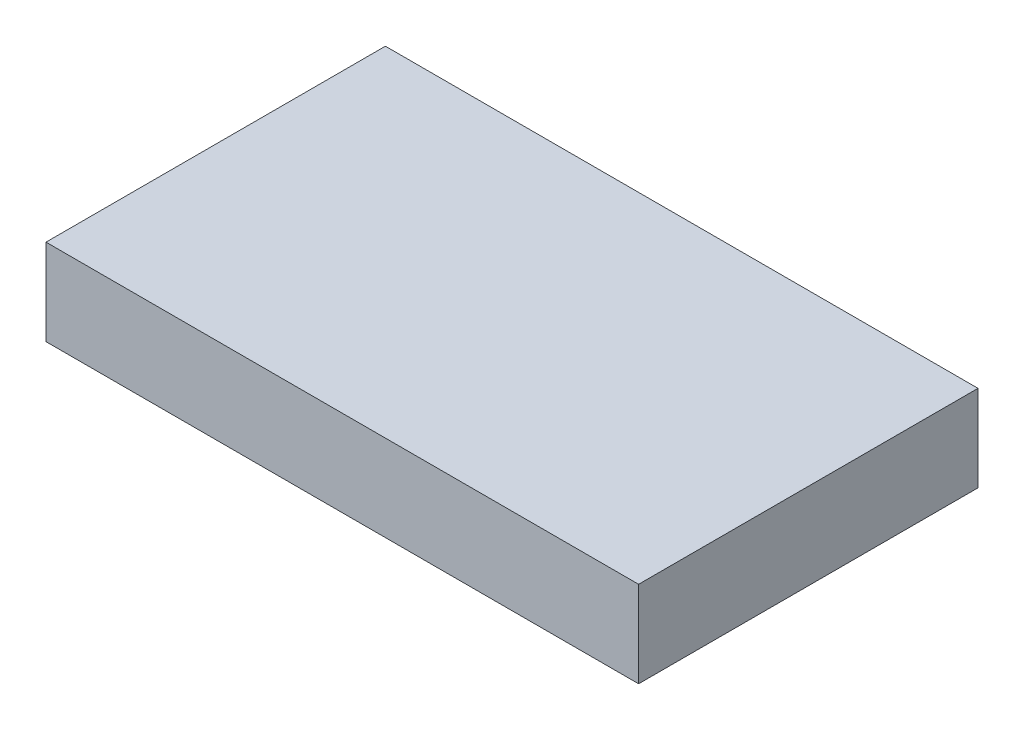
ISO-10303-21;
HEADER;
FILE_DESCRIPTION(('STEP AP214'),'2;1');
FILE_NAME('part.step','',(''),(''),'','','');
FILE_SCHEMA(('AUTOMOTIVE_DESIGN { 1 0 10303 214 1 1 1 1 }'));
ENDSEC;
DATA;
#1=APPLICATION_CONTEXT('core data for automotive mechanical design processes');
#2=APPLICATION_PROTOCOL_DEFINITION('international standard','automotive_design',2000,#1);
#3=PRODUCT_CONTEXT('',#1,'mechanical');
#4=PRODUCT('Part','Part','',(#3));
#5=PRODUCT_RELATED_PRODUCT_CATEGORY('part','',(#4));
#6=PRODUCT_DEFINITION_FORMATION('','',#4);
#7=PRODUCT_DEFINITION_CONTEXT('part definition',#1,'design');
#8=PRODUCT_DEFINITION('design','',#6,#7);
#9=PRODUCT_DEFINITION_SHAPE('','',#8);
#10=(LENGTH_UNIT() NAMED_UNIT(*) SI_UNIT(.MILLI.,.METRE.));
#11=(NAMED_UNIT(*) PLANE_ANGLE_UNIT() SI_UNIT($,.RADIAN.));
#12=(NAMED_UNIT(*) SI_UNIT($,.STERADIAN.) SOLID_ANGLE_UNIT());
#13=UNCERTAINTY_MEASURE_WITH_UNIT(LENGTH_MEASURE(1.E-05),#10,'distance_accuracy_value','');
#14=(GEOMETRIC_REPRESENTATION_CONTEXT(3) GLOBAL_UNCERTAINTY_ASSIGNED_CONTEXT((#13)) GLOBAL_UNIT_ASSIGNED_CONTEXT((#10,
#11,#12)) REPRESENTATION_CONTEXT('',''));
#15=CARTESIAN_POINT('',(0.,0.,0.));
#16=DIRECTION('',(0.,0.,1.));
#17=DIRECTION('',(1.,0.,0.));
#18=AXIS2_PLACEMENT_3D('',#15,#16,#17);
#19=CARTESIAN_POINT('',(33.,0.,9.45));
#20=DIRECTION('',(0.,0.,-1.));
#21=DIRECTION('',(-1.,0.,0.));
#22=AXIS2_PLACEMENT_3D('',#19,#20,#21);
#23=PLANE('',#22);
#24=DIRECTION('',(0.,-1.,0.));
#25=VECTOR('',#24,1.);
#26=CARTESIAN_POINT('',(0.,0.,9.45));
#27=LINE('',#26,#25);
#28=CARTESIAN_POINT('',(0.,4.8,9.45));
#29=VERTEX_POINT('',#28);
#30=CARTESIAN_POINT('',(0.,0.,9.45));
#31=VERTEX_POINT('',#30);
#32=EDGE_CURVE('E95',#29,#31,#27,.T.);
#33=ORIENTED_EDGE('',*,*,#32,.T.);
#34=DIRECTION('',(-1.,0.,0.));
#35=VECTOR('',#34,1.);
#36=CARTESIAN_POINT('',(33.,0.,9.45));
#37=LINE('',#36,#35);
#38=CARTESIAN_POINT('',(33.,0.,9.45));
#39=VERTEX_POINT('',#38);
#40=EDGE_CURVE('E11',#39,#31,#37,.T.);
#41=ORIENTED_EDGE('',*,*,#40,.F.);
#42=DIRECTION('',(0.,-1.,0.));
#43=VECTOR('',#42,1.);
#44=CARTESIAN_POINT('',(33.,0.,9.45));
#45=LINE('',#44,#43);
#46=CARTESIAN_POINT('',(33.,4.8,9.45));
#47=VERTEX_POINT('',#46);
#48=EDGE_CURVE('E83',#47,#39,#45,.T.);
#49=ORIENTED_EDGE('',*,*,#48,.F.);
#50=DIRECTION('',(-1.,0.,0.));
#51=VECTOR('',#50,1.);
#52=CARTESIAN_POINT('',(33.,4.8,9.45));
#53=LINE('',#52,#51);
#54=EDGE_CURVE('E91',#47,#29,#53,.T.);
#55=ORIENTED_EDGE('',*,*,#54,.T.);
#56=EDGE_LOOP('',(#33,#41,#49,#55));
#57=FACE_BOUND('',#56,.T.);
#58=ADVANCED_FACE('F32',(#57),#23,.F.);
#59=CARTESIAN_POINT('',(33.,0.,9.45));
#60=DIRECTION('',(0.,1.,0.));
#61=DIRECTION('',(0.,0.,1.));
#62=AXIS2_PLACEMENT_3D('',#59,#60,#61);
#63=PLANE('',#62);
#64=DIRECTION('',(0.,0.,-1.));
#65=VECTOR('',#64,1.);
#66=CARTESIAN_POINT('',(0.,0.,9.45));
#67=LINE('',#66,#65);
#68=CARTESIAN_POINT('',(0.,0.,-9.45));
#69=VERTEX_POINT('',#68);
#70=EDGE_CURVE('E87',#31,#69,#67,.T.);
#71=ORIENTED_EDGE('',*,*,#70,.T.);
#72=DIRECTION('',(-1.,0.,0.));
#73=VECTOR('',#72,1.);
#74=CARTESIAN_POINT('',(33.,0.,-9.45));
#75=LINE('',#74,#73);
#76=CARTESIAN_POINT('',(33.,0.,-9.45));
#77=VERTEX_POINT('',#76);
#78=EDGE_CURVE('E40',#77,#69,#75,.T.);
#79=ORIENTED_EDGE('',*,*,#78,.F.);
#80=DIRECTION('',(0.,0.,-1.));
#81=VECTOR('',#80,1.);
#82=CARTESIAN_POINT('',(33.,0.,9.45));
#83=LINE('',#82,#81);
#84=EDGE_CURVE('E78',#39,#77,#83,.T.);
#85=ORIENTED_EDGE('',*,*,#84,.F.);
#86=ORIENTED_EDGE('',*,*,#40,.T.);
#87=EDGE_LOOP('',(#71,#79,#85,#86));
#88=FACE_BOUND('',#87,.T.);
#89=ADVANCED_FACE('F86',(#88),#63,.F.);
#90=CARTESIAN_POINT('',(33.,0.,-9.45));
#91=DIRECTION('',(0.,0.,1.));
#92=DIRECTION('',(1.,0.,0.));
#93=AXIS2_PLACEMENT_3D('',#90,#91,#92);
#94=PLANE('',#93);
#95=DIRECTION('',(0.,1.,0.));
#96=VECTOR('',#95,1.);
#97=CARTESIAN_POINT('',(0.,0.,-9.45));
#98=LINE('',#97,#96);
#99=CARTESIAN_POINT('',(0.,4.8,-9.45));
#100=VERTEX_POINT('',#99);
#101=EDGE_CURVE('E65',#69,#100,#98,.T.);
#102=ORIENTED_EDGE('',*,*,#101,.T.);
#103=DIRECTION('',(-1.,0.,0.));
#104=VECTOR('',#103,1.);
#105=CARTESIAN_POINT('',(33.,4.8,-9.45));
#106=LINE('',#105,#104);
#107=CARTESIAN_POINT('',(33.,4.8,-9.45));
#108=VERTEX_POINT('',#107);
#109=EDGE_CURVE('E88',#108,#100,#106,.T.);
#110=ORIENTED_EDGE('',*,*,#109,.F.);
#111=DIRECTION('',(0.,1.,0.));
#112=VECTOR('',#111,1.);
#113=CARTESIAN_POINT('',(33.,0.,-9.45));
#114=LINE('',#113,#112);
#115=EDGE_CURVE('E81',#77,#108,#114,.T.);
#116=ORIENTED_EDGE('',*,*,#115,.F.);
#117=ORIENTED_EDGE('',*,*,#78,.T.);
#118=EDGE_LOOP('',(#102,#110,#116,#117));
#119=FACE_BOUND('',#118,.T.);
#120=ADVANCED_FACE('F89',(#119),#94,.F.);
#121=CARTESIAN_POINT('',(33.,4.8,9.45));
#122=DIRECTION('',(0.,-1.,0.));
#123=DIRECTION('',(0.,0.,-1.));
#124=AXIS2_PLACEMENT_3D('',#121,#122,#123);
#125=PLANE('',#124);
#126=DIRECTION('',(0.,0.,1.));
#127=VECTOR('',#126,1.);
#128=CARTESIAN_POINT('',(0.,4.8,9.45));
#129=LINE('',#128,#127);
#130=EDGE_CURVE('E71',#100,#29,#129,.T.);
#131=ORIENTED_EDGE('',*,*,#130,.T.);
#132=ORIENTED_EDGE('',*,*,#54,.F.);
#133=DIRECTION('',(0.,0.,1.));
#134=VECTOR('',#133,1.);
#135=CARTESIAN_POINT('',(33.,4.8,9.45));
#136=LINE('',#135,#134);
#137=EDGE_CURVE('E48',#108,#47,#136,.T.);
#138=ORIENTED_EDGE('',*,*,#137,.F.);
#139=ORIENTED_EDGE('',*,*,#109,.T.);
#140=EDGE_LOOP('',(#131,#132,#138,#139));
#141=FACE_BOUND('',#140,.T.);
#142=ADVANCED_FACE('F102',(#141),#125,.F.);
#143=CARTESIAN_POINT('',(33.,0.,0.));
#144=DIRECTION('',(-1.,0.,0.));
#145=DIRECTION('',(0.,0.,1.));
#146=AXIS2_PLACEMENT_3D('',#143,#144,#145);
#147=PLANE('',#146);
#148=ORIENTED_EDGE('',*,*,#48,.T.);
#149=ORIENTED_EDGE('',*,*,#84,.T.);
#150=ORIENTED_EDGE('',*,*,#115,.T.);
#151=ORIENTED_EDGE('',*,*,#137,.T.);
#152=EDGE_LOOP('',(#148,#149,#150,#151));
#153=FACE_BOUND('',#152,.T.);
#154=ADVANCED_FACE('F79',(#153),#147,.F.);
#155=CARTESIAN_POINT('',(0.,0.,0.));
#156=DIRECTION('',(-1.,0.,0.));
#157=DIRECTION('',(0.,0.,1.));
#158=AXIS2_PLACEMENT_3D('',#155,#156,#157);
#159=PLANE('',#158);
#160=ORIENTED_EDGE('',*,*,#32,.F.);
#161=ORIENTED_EDGE('',*,*,#130,.F.);
#162=ORIENTED_EDGE('',*,*,#101,.F.);
#163=ORIENTED_EDGE('',*,*,#70,.F.);
#164=EDGE_LOOP('',(#160,#161,#162,#163));
#165=FACE_BOUND('',#164,.T.);
#166=ADVANCED_FACE('F105',(#165),#159,.T.);
#167=CLOSED_SHELL('',(#58,#89,#120,#142,#154,#166));
#168=MANIFOLD_SOLID_BREP('B2',#167);
#169=ADVANCED_BREP_SHAPE_REPRESENTATION('',(#18,#168),#14);
#170=SHAPE_DEFINITION_REPRESENTATION(#9,#169);
ENDSEC;
END-ISO-10303-21;
